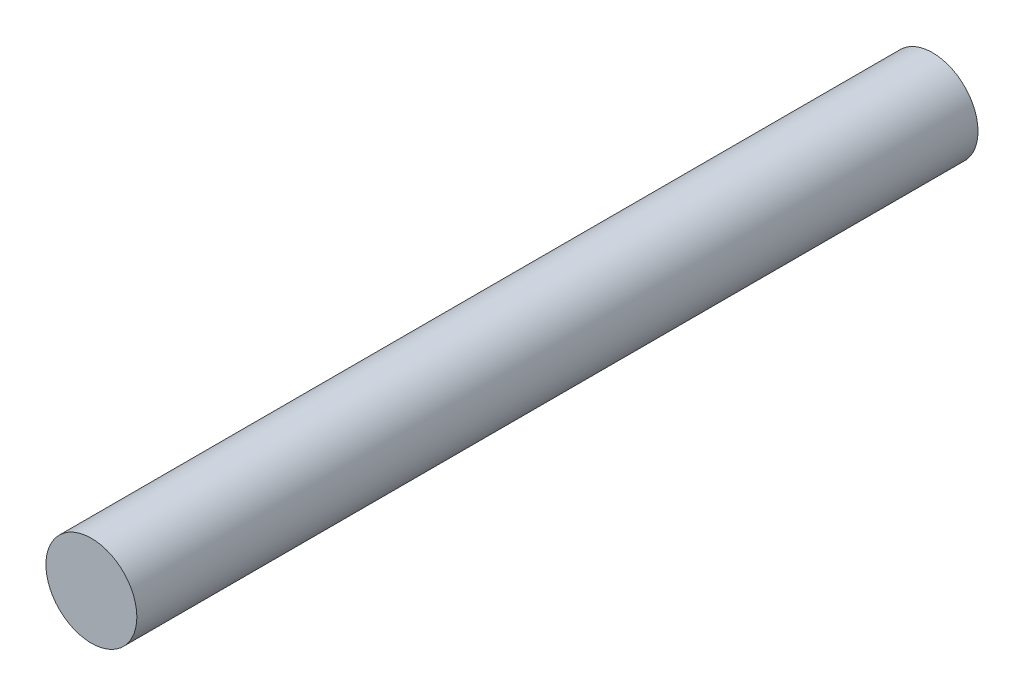
ISO-10303-21;
HEADER;
FILE_DESCRIPTION(('STEP AP214'),'2;1');
FILE_NAME('part.step','',(''),(''),'','','');
FILE_SCHEMA(('AUTOMOTIVE_DESIGN { 1 0 10303 214 1 1 1 1 }'));
ENDSEC;
DATA;
#1=APPLICATION_CONTEXT('core data for automotive mechanical design processes');
#2=APPLICATION_PROTOCOL_DEFINITION('international standard','automotive_design',2000,#1);
#3=PRODUCT_CONTEXT('',#1,'mechanical');
#4=PRODUCT('Part','Part','',(#3));
#5=PRODUCT_RELATED_PRODUCT_CATEGORY('part','',(#4));
#6=PRODUCT_DEFINITION_FORMATION('','',#4);
#7=PRODUCT_DEFINITION_CONTEXT('part definition',#1,'design');
#8=PRODUCT_DEFINITION('design','',#6,#7);
#9=PRODUCT_DEFINITION_SHAPE('','',#8);
#10=(LENGTH_UNIT() NAMED_UNIT(*) SI_UNIT(.MILLI.,.METRE.));
#11=(NAMED_UNIT(*) PLANE_ANGLE_UNIT() SI_UNIT($,.RADIAN.));
#12=(NAMED_UNIT(*) SI_UNIT($,.STERADIAN.) SOLID_ANGLE_UNIT());
#13=UNCERTAINTY_MEASURE_WITH_UNIT(LENGTH_MEASURE(1.E-05),#10,'distance_accuracy_value','');
#14=(GEOMETRIC_REPRESENTATION_CONTEXT(3) GLOBAL_UNCERTAINTY_ASSIGNED_CONTEXT((#13)) GLOBAL_UNIT_ASSIGNED_CONTEXT((#10,
#11,#12)) REPRESENTATION_CONTEXT('',''));
#15=CARTESIAN_POINT('',(0.,0.,0.));
#16=DIRECTION('',(0.,0.,1.));
#17=DIRECTION('',(1.,0.,0.));
#18=AXIS2_PLACEMENT_3D('',#15,#16,#17);
#19=CARTESIAN_POINT('',(0.,0.,234.95));
#20=DIRECTION('',(0.,0.,-1.));
#21=DIRECTION('',(-1.,0.,0.));
#22=AXIS2_PLACEMENT_3D('',#19,#20,#21);
#23=CYLINDRICAL_SURFACE('',#22,25.4);
#24=CARTESIAN_POINT('',(0.,0.,234.95));
#25=DIRECTION('',(0.,0.,1.));
#26=DIRECTION('',(1.,0.,0.));
#27=AXIS2_PLACEMENT_3D('',#24,#25,#26);
#28=CIRCLE('',#27,25.4);
#29=CARTESIAN_POINT('',(25.4,0.,234.95));
#30=VERTEX_POINT('',#29);
#31=EDGE_CURVE('E10',#30,#30,#28,.T.);
#32=ORIENTED_EDGE('',*,*,#31,.F.);
#33=EDGE_LOOP('',(#32));
#34=FACE_BOUND('',#33,.T.);
#35=CARTESIAN_POINT('',(0.,0.,-234.95));
#36=DIRECTION('',(0.,0.,1.));
#37=DIRECTION('',(1.,0.,0.));
#38=AXIS2_PLACEMENT_3D('',#35,#36,#37);
#39=CIRCLE('',#38,25.4);
#40=CARTESIAN_POINT('',(25.4,0.,-234.95));
#41=VERTEX_POINT('',#40);
#42=EDGE_CURVE('E44',#41,#41,#39,.T.);
#43=ORIENTED_EDGE('',*,*,#42,.T.);
#44=EDGE_LOOP('',(#43));
#45=FACE_BOUND('',#44,.T.);
#46=ADVANCED_FACE('F41',(#34,#45),#23,.T.);
#47=CARTESIAN_POINT('',(0.,0.,234.95));
#48=DIRECTION('',(0.,0.,1.));
#49=DIRECTION('',(1.,0.,0.));
#50=AXIS2_PLACEMENT_3D('',#47,#48,#49);
#51=PLANE('',#50);
#52=ORIENTED_EDGE('',*,*,#31,.T.);
#53=EDGE_LOOP('',(#52));
#54=FACE_BOUND('',#53,.T.);
#55=ADVANCED_FACE('F58',(#54),#51,.T.);
#56=CARTESIAN_POINT('',(0.,0.,-234.95));
#57=DIRECTION('',(0.,0.,1.));
#58=DIRECTION('',(1.,0.,0.));
#59=AXIS2_PLACEMENT_3D('',#56,#57,#58);
#60=PLANE('',#59);
#61=ORIENTED_EDGE('',*,*,#42,.F.);
#62=EDGE_LOOP('',(#61));
#63=FACE_BOUND('',#62,.T.);
#64=ADVANCED_FACE('F56',(#63),#60,.F.);
#65=CLOSED_SHELL('',(#46,#55,#64));
#66=MANIFOLD_SOLID_BREP('B2',#65);
#67=ADVANCED_BREP_SHAPE_REPRESENTATION('',(#18,#66),#14);
#68=SHAPE_DEFINITION_REPRESENTATION(#9,#67);
ENDSEC;
END-ISO-10303-21;
